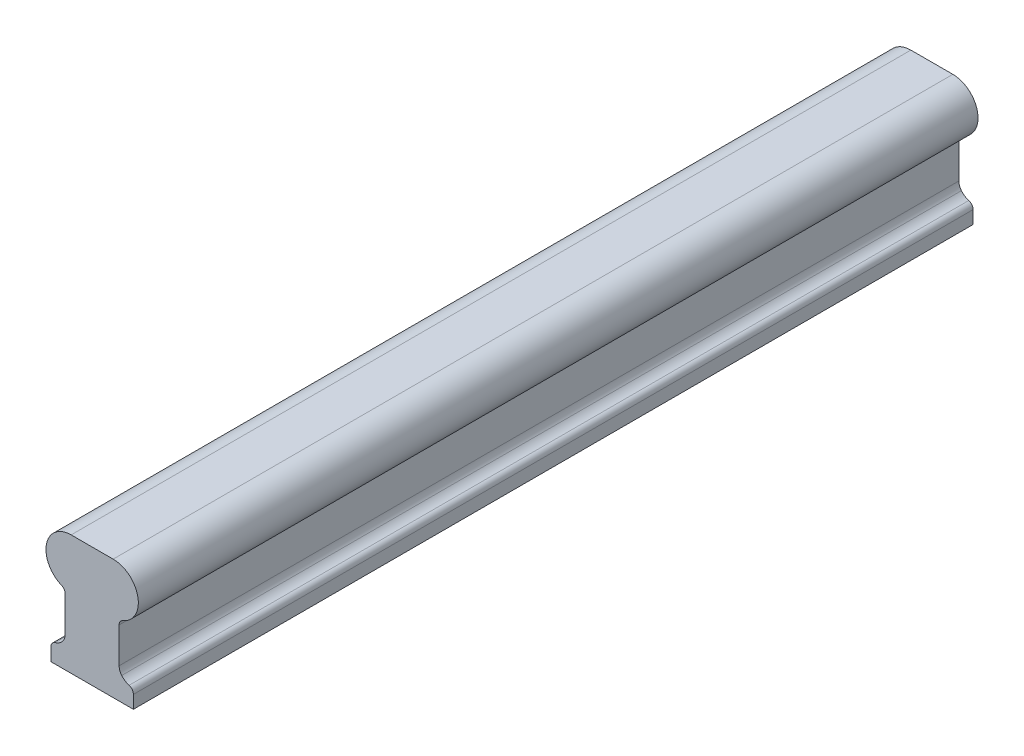
ISO-10303-21;
HEADER;
FILE_DESCRIPTION(('STEP AP214'),'2;1');
FILE_NAME('part.step','',(''),(''),'','','');
FILE_SCHEMA(('AUTOMOTIVE_DESIGN { 1 0 10303 214 1 1 1 1 }'));
ENDSEC;
DATA;
#1=APPLICATION_CONTEXT('core data for automotive mechanical design processes');
#2=APPLICATION_PROTOCOL_DEFINITION('international standard','automotive_design',2000,#1);
#3=PRODUCT_CONTEXT('',#1,'mechanical');
#4=PRODUCT('Part','Part','',(#3));
#5=PRODUCT_RELATED_PRODUCT_CATEGORY('part','',(#4));
#6=PRODUCT_DEFINITION_FORMATION('','',#4);
#7=PRODUCT_DEFINITION_CONTEXT('part definition',#1,'design');
#8=PRODUCT_DEFINITION('design','',#6,#7);
#9=PRODUCT_DEFINITION_SHAPE('','',#8);
#10=(LENGTH_UNIT() NAMED_UNIT(*) SI_UNIT(.MILLI.,.METRE.));
#11=(NAMED_UNIT(*) PLANE_ANGLE_UNIT() SI_UNIT($,.RADIAN.));
#12=(NAMED_UNIT(*) SI_UNIT($,.STERADIAN.) SOLID_ANGLE_UNIT());
#13=UNCERTAINTY_MEASURE_WITH_UNIT(LENGTH_MEASURE(1.E-05),#10,'distance_accuracy_value','');
#14=(GEOMETRIC_REPRESENTATION_CONTEXT(3) GLOBAL_UNCERTAINTY_ASSIGNED_CONTEXT((#13)) GLOBAL_UNIT_ASSIGNED_CONTEXT((#10,
#11,#12)) REPRESENTATION_CONTEXT('',''));
#15=CARTESIAN_POINT('',(0.,0.,0.));
#16=DIRECTION('',(0.,0.,1.));
#17=DIRECTION('',(1.,0.,0.));
#18=AXIS2_PLACEMENT_3D('',#15,#16,#17);
#19=CARTESIAN_POINT('',(0.,0.,355.6));
#20=DIRECTION('',(1.,0.,0.));
#21=DIRECTION('',(0.,0.,-1.));
#22=AXIS2_PLACEMENT_3D('',#19,#20,#21);
#23=PLANE('',#22);
#24=DIRECTION('',(0.,-1.,0.));
#25=VECTOR('',#24,1.);
#26=CARTESIAN_POINT('',(0.,0.,0.));
#27=LINE('',#26,#25);
#28=CARTESIAN_POINT('',(0.,5.4700903291992,0.));
#29=VERTEX_POINT('',#28);
#30=CARTESIAN_POINT('',(0.,0.,0.));
#31=VERTEX_POINT('',#30);
#32=EDGE_CURVE('E177',#29,#31,#27,.T.);
#33=ORIENTED_EDGE('',*,*,#32,.T.);
#34=DIRECTION('',(0.,0.,-1.));
#35=VECTOR('',#34,1.);
#36=CARTESIAN_POINT('',(0.,0.,355.6));
#37=LINE('',#36,#35);
#38=CARTESIAN_POINT('',(0.,0.,355.6));
#39=VERTEX_POINT('',#38);
#40=EDGE_CURVE('E11',#39,#31,#37,.T.);
#41=ORIENTED_EDGE('',*,*,#40,.F.);
#42=DIRECTION('',(0.,-1.,0.));
#43=VECTOR('',#42,1.);
#44=CARTESIAN_POINT('',(0.,0.,355.6));
#45=LINE('',#44,#43);
#46=CARTESIAN_POINT('',(0.,5.4700903291992,355.6));
#47=VERTEX_POINT('',#46);
#48=EDGE_CURVE('E207',#47,#39,#45,.T.);
#49=ORIENTED_EDGE('',*,*,#48,.F.);
#50=DIRECTION('',(0.,0.,-1.));
#51=VECTOR('',#50,1.);
#52=CARTESIAN_POINT('',(0.,5.4700903291992,355.6));
#53=LINE('',#52,#51);
#54=EDGE_CURVE('E173',#47,#29,#53,.T.);
#55=ORIENTED_EDGE('',*,*,#54,.T.);
#56=EDGE_LOOP('',(#33,#41,#49,#55));
#57=FACE_BOUND('',#56,.T.);
#58=ADVANCED_FACE('F33',(#57),#23,.F.);
#59=CARTESIAN_POINT('',(0.,0.,355.6));
#60=DIRECTION('',(0.,1.,0.));
#61=DIRECTION('',(0.,0.,1.));
#62=AXIS2_PLACEMENT_3D('',#59,#60,#61);
#63=PLANE('',#62);
#64=DIRECTION('',(1.,0.,0.));
#65=VECTOR('',#64,1.);
#66=CARTESIAN_POINT('',(0.,0.,0.));
#67=LINE('',#66,#65);
#68=CARTESIAN_POINT('',(34.925,0.,0.));
#69=VERTEX_POINT('',#68);
#70=EDGE_CURVE('E180',#31,#69,#67,.T.);
#71=ORIENTED_EDGE('',*,*,#70,.T.);
#72=DIRECTION('',(0.,0.,-1.));
#73=VECTOR('',#72,1.);
#74=CARTESIAN_POINT('',(34.925,0.,355.6));
#75=LINE('',#74,#73);
#76=CARTESIAN_POINT('',(34.925,0.,355.6));
#77=VERTEX_POINT('',#76);
#78=EDGE_CURVE('E41',#77,#69,#75,.T.);
#79=ORIENTED_EDGE('',*,*,#78,.F.);
#80=DIRECTION('',(1.,0.,0.));
#81=VECTOR('',#80,1.);
#82=CARTESIAN_POINT('',(0.,0.,355.6));
#83=LINE('',#82,#81);
#84=EDGE_CURVE('E116',#39,#77,#83,.T.);
#85=ORIENTED_EDGE('',*,*,#84,.F.);
#86=ORIENTED_EDGE('',*,*,#40,.T.);
#87=EDGE_LOOP('',(#71,#79,#85,#86));
#88=FACE_BOUND('',#87,.T.);
#89=ADVANCED_FACE('F305',(#88),#63,.F.);
#90=CARTESIAN_POINT('',(34.925,0.,355.6));
#91=DIRECTION('',(-1.,0.,0.));
#92=DIRECTION('',(0.,0.,1.));
#93=AXIS2_PLACEMENT_3D('',#90,#91,#92);
#94=PLANE('',#93);
#95=DIRECTION('',(0.,1.,0.));
#96=VECTOR('',#95,1.);
#97=CARTESIAN_POINT('',(34.925,0.,0.));
#98=LINE('',#97,#96);
#99=CARTESIAN_POINT('',(34.925,5.4700903291992,0.));
#100=VERTEX_POINT('',#99);
#101=EDGE_CURVE('E182',#69,#100,#98,.T.);
#102=ORIENTED_EDGE('',*,*,#101,.T.);
#103=DIRECTION('',(0.,0.,-1.));
#104=VECTOR('',#103,1.);
#105=CARTESIAN_POINT('',(34.925,5.4700903291992,355.6));
#106=LINE('',#105,#104);
#107=CARTESIAN_POINT('',(34.925,5.4700903291992,355.6));
#108=VERTEX_POINT('',#107);
#109=EDGE_CURVE('E238',#108,#100,#106,.T.);
#110=ORIENTED_EDGE('',*,*,#109,.F.);
#111=DIRECTION('',(0.,1.,0.));
#112=VECTOR('',#111,1.);
#113=CARTESIAN_POINT('',(34.925,0.,355.6));
#114=LINE('',#113,#112);
#115=EDGE_CURVE('E246',#77,#108,#114,.T.);
#116=ORIENTED_EDGE('',*,*,#115,.F.);
#117=ORIENTED_EDGE('',*,*,#78,.T.);
#118=EDGE_LOOP('',(#102,#110,#116,#117));
#119=FACE_BOUND('',#118,.T.);
#120=ADVANCED_FACE('F244',(#119),#94,.F.);
#121=CARTESIAN_POINT('',(32.385,5.4700903291992,355.6));
#122=DIRECTION('',(0.,0.,-1.));
#123=DIRECTION('',(-1.,0.,0.));
#124=AXIS2_PLACEMENT_3D('',#121,#122,#123);
#125=CYLINDRICAL_SURFACE('',#124,2.54);
#126=CARTESIAN_POINT('',(32.385,5.4700903291992,0.));
#127=DIRECTION('',(0.,0.,1.));
#128=DIRECTION('',(-1.,0.,0.));
#129=AXIS2_PLACEMENT_3D('',#126,#127,#128);
#130=CIRCLE('',#129,2.54);
#131=CARTESIAN_POINT('',(33.1030882831289,7.90647068079312,0.));
#132=VERTEX_POINT('',#131);
#133=EDGE_CURVE('E184',#100,#132,#130,.T.);
#134=ORIENTED_EDGE('',*,*,#133,.T.);
#135=DIRECTION('',(0.,0.,-1.));
#136=VECTOR('',#135,1.);
#137=CARTESIAN_POINT('',(33.1030882831289,7.90647068079312,355.6));
#138=LINE('',#137,#136);
#139=CARTESIAN_POINT('',(33.1030882831289,7.90647068079312,355.6));
#140=VERTEX_POINT('',#139);
#141=EDGE_CURVE('E235',#140,#132,#138,.T.);
#142=ORIENTED_EDGE('',*,*,#141,.F.);
#143=CARTESIAN_POINT('',(32.385,5.4700903291992,355.6));
#144=DIRECTION('',(0.,0.,1.));
#145=DIRECTION('',(-1.,0.,0.));
#146=AXIS2_PLACEMENT_3D('',#143,#144,#145);
#147=CIRCLE('',#146,2.54);
#148=EDGE_CURVE('E264',#108,#140,#147,.T.);
#149=ORIENTED_EDGE('',*,*,#148,.F.);
#150=ORIENTED_EDGE('',*,*,#109,.T.);
#151=EDGE_LOOP('',(#134,#142,#149,#150));
#152=FACE_BOUND('',#151,.T.);
#153=ADVANCED_FACE('F255',(#152),#125,.T.);
#154=CARTESIAN_POINT('',(34.925,14.0879806895373,355.6));
#155=DIRECTION('',(0.,0.,-1.));
#156=DIRECTION('',(-1.,0.,0.));
#157=AXIS2_PLACEMENT_3D('',#154,#155,#156);
#158=CYLINDRICAL_SURFACE('',#157,6.44441062412048);
#159=CARTESIAN_POINT('',(34.925,14.0879806895373,0.));
#160=DIRECTION('',(0.,0.,-1.));
#161=DIRECTION('',(-1.,0.,0.));
#162=AXIS2_PLACEMENT_3D('',#159,#160,#161);
#163=CIRCLE('',#162,6.44441062412048);
#164=CARTESIAN_POINT('',(29.9877953084063,9.94618903306999,0.));
#165=VERTEX_POINT('',#164);
#166=EDGE_CURVE('E186',#132,#165,#163,.T.);
#167=ORIENTED_EDGE('',*,*,#166,.T.);
#168=DIRECTION('',(0.,0.,-1.));
#169=VECTOR('',#168,1.);
#170=CARTESIAN_POINT('',(29.9877953084063,9.94618903306999,355.6));
#171=LINE('',#170,#169);
#172=CARTESIAN_POINT('',(29.9877953084063,9.94618903306999,355.6));
#173=VERTEX_POINT('',#172);
#174=EDGE_CURVE('E232',#173,#165,#171,.T.);
#175=ORIENTED_EDGE('',*,*,#174,.F.);
#176=CARTESIAN_POINT('',(34.925,14.0879806895373,355.6));
#177=DIRECTION('',(0.,0.,-1.));
#178=DIRECTION('',(-1.,0.,0.));
#179=AXIS2_PLACEMENT_3D('',#176,#177,#178);
#180=CIRCLE('',#179,6.44441062412048);
#181=EDGE_CURVE('E261',#140,#173,#180,.T.);
#182=ORIENTED_EDGE('',*,*,#181,.F.);
#183=ORIENTED_EDGE('',*,*,#141,.T.);
#184=EDGE_LOOP('',(#167,#175,#182,#183));
#185=FACE_BOUND('',#184,.T.);
#186=ADVANCED_FACE('F259',(#185),#158,.F.);
#187=CARTESIAN_POINT('',(33.5756906441674,12.9560530946583,355.6));
#188=DIRECTION('',(0.,0.,-1.));
#189=DIRECTION('',(-1.,0.,0.));
#190=AXIS2_PLACEMENT_3D('',#187,#188,#189);
#191=CYLINDRICAL_SURFACE('',#190,4.68319064416736);
#192=CARTESIAN_POINT('',(33.5756906441674,12.9560530946583,0.));
#193=DIRECTION('',(0.,0.,-1.));
#194=DIRECTION('',(1.,0.,0.));
#195=AXIS2_PLACEMENT_3D('',#192,#193,#194);
#196=CIRCLE('',#195,4.68319064416736);
#197=CARTESIAN_POINT('',(28.8925,12.9560530946583,0.));
#198=VERTEX_POINT('',#197);
#199=EDGE_CURVE('E188',#165,#198,#196,.T.);
#200=ORIENTED_EDGE('',*,*,#199,.T.);
#201=DIRECTION('',(0.,0.,-1.));
#202=VECTOR('',#201,1.);
#203=CARTESIAN_POINT('',(28.8925,12.9560530946583,355.6));
#204=LINE('',#203,#202);
#205=CARTESIAN_POINT('',(28.8925,12.9560530946583,355.6));
#206=VERTEX_POINT('',#205);
#207=EDGE_CURVE('E229',#206,#198,#204,.T.);
#208=ORIENTED_EDGE('',*,*,#207,.F.);
#209=CARTESIAN_POINT('',(33.5756906441674,12.9560530946583,355.6));
#210=DIRECTION('',(0.,0.,-1.));
#211=DIRECTION('',(1.,0.,0.));
#212=AXIS2_PLACEMENT_3D('',#209,#210,#211);
#213=CIRCLE('',#212,4.68319064416736);
#214=EDGE_CURVE('E263',#173,#206,#213,.T.);
#215=ORIENTED_EDGE('',*,*,#214,.F.);
#216=ORIENTED_EDGE('',*,*,#174,.T.);
#217=EDGE_LOOP('',(#200,#208,#215,#216));
#218=FACE_BOUND('',#217,.T.);
#219=ADVANCED_FACE('F318',(#218),#191,.F.);
#220=CARTESIAN_POINT('',(28.8925,27.94,355.6));
#221=DIRECTION('',(-1.,0.,0.));
#222=DIRECTION('',(0.,-1.,0.));
#223=AXIS2_PLACEMENT_3D('',#220,#221,#222);
#224=PLANE('',#223);
#225=DIRECTION('',(0.,1.,0.));
#226=VECTOR('',#225,1.);
#227=CARTESIAN_POINT('',(28.8925,27.94,0.));
#228=LINE('',#227,#226);
#229=CARTESIAN_POINT('',(28.8925,27.94,0.));
#230=VERTEX_POINT('',#229);
#231=EDGE_CURVE('E190',#198,#230,#228,.T.);
#232=ORIENTED_EDGE('',*,*,#231,.T.);
#233=DIRECTION('',(0.,0.,-1.));
#234=VECTOR('',#233,1.);
#235=CARTESIAN_POINT('',(28.8925,27.94,355.6));
#236=LINE('',#235,#234);
#237=CARTESIAN_POINT('',(28.8925,27.94,355.6));
#238=VERTEX_POINT('',#237);
#239=EDGE_CURVE('E226',#238,#230,#236,.T.);
#240=ORIENTED_EDGE('',*,*,#239,.F.);
#241=DIRECTION('',(0.,1.,0.));
#242=VECTOR('',#241,1.);
#243=CARTESIAN_POINT('',(28.8925,27.94,355.6));
#244=LINE('',#243,#242);
#245=EDGE_CURVE('E266',#206,#238,#244,.T.);
#246=ORIENTED_EDGE('',*,*,#245,.F.);
#247=ORIENTED_EDGE('',*,*,#207,.T.);
#248=EDGE_LOOP('',(#232,#240,#246,#247));
#249=FACE_BOUND('',#248,.T.);
#250=ADVANCED_FACE('F321',(#249),#224,.F.);
#251=CARTESIAN_POINT('',(31.4325,27.94,355.6));
#252=DIRECTION('',(0.,0.,-1.));
#253=DIRECTION('',(-1.,0.,0.));
#254=AXIS2_PLACEMENT_3D('',#251,#252,#253);
#255=CYLINDRICAL_SURFACE('',#254,2.54);
#256=CARTESIAN_POINT('',(31.4325,27.94,0.));
#257=DIRECTION('',(0.,0.,-1.));
#258=DIRECTION('',(-1.,0.,0.));
#259=AXIS2_PLACEMENT_3D('',#256,#257,#258);
#260=CIRCLE('',#259,2.54);
#261=CARTESIAN_POINT('',(30.4555769230769,30.2846153846154,0.));
#262=VERTEX_POINT('',#261);
#263=EDGE_CURVE('E192',#230,#262,#260,.T.);
#264=ORIENTED_EDGE('',*,*,#263,.T.);
#265=DIRECTION('',(0.,0.,-1.));
#266=VECTOR('',#265,1.);
#267=CARTESIAN_POINT('',(30.4555769230769,30.2846153846154,355.6));
#268=LINE('',#267,#266);
#269=CARTESIAN_POINT('',(30.4555769230769,30.2846153846154,355.6));
#270=VERTEX_POINT('',#269);
#271=EDGE_CURVE('E223',#270,#262,#268,.T.);
#272=ORIENTED_EDGE('',*,*,#271,.F.);
#273=CARTESIAN_POINT('',(31.4325,27.94,355.6));
#274=DIRECTION('',(0.,0.,-1.));
#275=DIRECTION('',(-1.,0.,0.));
#276=AXIS2_PLACEMENT_3D('',#273,#274,#275);
#277=CIRCLE('',#276,2.54);
#278=EDGE_CURVE('E272',#238,#270,#277,.T.);
#279=ORIENTED_EDGE('',*,*,#278,.F.);
#280=ORIENTED_EDGE('',*,*,#239,.T.);
#281=EDGE_LOOP('',(#264,#272,#279,#280));
#282=FACE_BOUND('',#281,.T.);
#283=ADVANCED_FACE('F325',(#282),#255,.F.);
#284=CARTESIAN_POINT('',(26.3525,40.132,355.6));
#285=DIRECTION('',(0.,0.,-1.));
#286=DIRECTION('',(-1.,0.,0.));
#287=AXIS2_PLACEMENT_3D('',#284,#285,#286);
#288=CYLINDRICAL_SURFACE('',#287,10.668);
#289=CARTESIAN_POINT('',(26.3525,40.132,0.));
#290=DIRECTION('',(0.,0.,1.));
#291=DIRECTION('',(-1.,0.,0.));
#292=AXIS2_PLACEMENT_3D('',#289,#290,#291);
#293=CIRCLE('',#292,10.668);
#294=CARTESIAN_POINT('',(26.3525,50.8,0.));
#295=VERTEX_POINT('',#294);
#296=EDGE_CURVE('E194',#262,#295,#293,.T.);
#297=ORIENTED_EDGE('',*,*,#296,.T.);
#298=DIRECTION('',(0.,0.,-1.));
#299=VECTOR('',#298,1.);
#300=CARTESIAN_POINT('',(26.3525,50.8,355.6));
#301=LINE('',#300,#299);
#302=CARTESIAN_POINT('',(26.3525,50.8,355.6));
#303=VERTEX_POINT('',#302);
#304=EDGE_CURVE('E220',#303,#295,#301,.T.);
#305=ORIENTED_EDGE('',*,*,#304,.F.);
#306=CARTESIAN_POINT('',(26.3525,40.132,355.6));
#307=DIRECTION('',(0.,0.,1.));
#308=DIRECTION('',(-1.,0.,0.));
#309=AXIS2_PLACEMENT_3D('',#306,#307,#308);
#310=CIRCLE('',#309,10.668);
#311=EDGE_CURVE('E274',#270,#303,#310,.T.);
#312=ORIENTED_EDGE('',*,*,#311,.F.);
#313=ORIENTED_EDGE('',*,*,#271,.T.);
#314=EDGE_LOOP('',(#297,#305,#312,#313));
#315=FACE_BOUND('',#314,.T.);
#316=ADVANCED_FACE('F329',(#315),#288,.T.);
#317=CARTESIAN_POINT('',(8.5725,50.8,355.6));
#318=DIRECTION('',(0.,-1.,0.));
#319=DIRECTION('',(0.,0.,-1.));
#320=AXIS2_PLACEMENT_3D('',#317,#318,#319);
#321=PLANE('',#320);
#322=DIRECTION('',(-1.,0.,0.));
#323=VECTOR('',#322,1.);
#324=CARTESIAN_POINT('',(8.5725,50.8,0.));
#325=LINE('',#324,#323);
#326=CARTESIAN_POINT('',(8.5725,50.8,0.));
#327=VERTEX_POINT('',#326);
#328=EDGE_CURVE('E196',#295,#327,#325,.T.);
#329=ORIENTED_EDGE('',*,*,#328,.T.);
#330=DIRECTION('',(0.,0.,-1.));
#331=VECTOR('',#330,1.);
#332=CARTESIAN_POINT('',(8.5725,50.8,355.6));
#333=LINE('',#332,#331);
#334=CARTESIAN_POINT('',(8.5725,50.8,355.6));
#335=VERTEX_POINT('',#334);
#336=EDGE_CURVE('E217',#335,#327,#333,.T.);
#337=ORIENTED_EDGE('',*,*,#336,.F.);
#338=DIRECTION('',(-1.,0.,0.));
#339=VECTOR('',#338,1.);
#340=CARTESIAN_POINT('',(8.5725,50.8,355.6));
#341=LINE('',#340,#339);
#342=EDGE_CURVE('E276',#303,#335,#341,.T.);
#343=ORIENTED_EDGE('',*,*,#342,.F.);
#344=ORIENTED_EDGE('',*,*,#304,.T.);
#345=EDGE_LOOP('',(#329,#337,#343,#344));
#346=FACE_BOUND('',#345,.T.);
#347=ADVANCED_FACE('F333',(#346),#321,.F.);
#348=CARTESIAN_POINT('',(8.5725,40.132,355.6));
#349=DIRECTION('',(0.,0.,-1.));
#350=DIRECTION('',(-1.,0.,0.));
#351=AXIS2_PLACEMENT_3D('',#348,#349,#350);
#352=CYLINDRICAL_SURFACE('',#351,10.668);
#353=CARTESIAN_POINT('',(8.5725,40.132,0.));
#354=DIRECTION('',(0.,0.,1.));
#355=DIRECTION('',(1.,0.,0.));
#356=AXIS2_PLACEMENT_3D('',#353,#354,#355);
#357=CIRCLE('',#356,10.668);
#358=CARTESIAN_POINT('',(4.46942307692308,30.2846153846154,0.));
#359=VERTEX_POINT('',#358);
#360=EDGE_CURVE('E198',#327,#359,#357,.T.);
#361=ORIENTED_EDGE('',*,*,#360,.T.);
#362=DIRECTION('',(0.,0.,-1.));
#363=VECTOR('',#362,1.);
#364=CARTESIAN_POINT('',(4.46942307692308,30.2846153846154,355.6));
#365=LINE('',#364,#363);
#366=CARTESIAN_POINT('',(4.46942307692308,30.2846153846154,355.6));
#367=VERTEX_POINT('',#366);
#368=EDGE_CURVE('E214',#367,#359,#365,.T.);
#369=ORIENTED_EDGE('',*,*,#368,.F.);
#370=CARTESIAN_POINT('',(8.5725,40.132,355.6));
#371=DIRECTION('',(0.,0.,1.));
#372=DIRECTION('',(1.,0.,0.));
#373=AXIS2_PLACEMENT_3D('',#370,#371,#372);
#374=CIRCLE('',#373,10.668);
#375=EDGE_CURVE('E278',#335,#367,#374,.T.);
#376=ORIENTED_EDGE('',*,*,#375,.F.);
#377=ORIENTED_EDGE('',*,*,#336,.T.);
#378=EDGE_LOOP('',(#361,#369,#376,#377));
#379=FACE_BOUND('',#378,.T.);
#380=ADVANCED_FACE('F337',(#379),#352,.T.);
#381=CARTESIAN_POINT('',(3.4925,27.94,355.6));
#382=DIRECTION('',(0.,0.,-1.));
#383=DIRECTION('',(-1.,0.,0.));
#384=AXIS2_PLACEMENT_3D('',#381,#382,#383);
#385=CYLINDRICAL_SURFACE('',#384,2.54);
#386=CARTESIAN_POINT('',(3.4925,27.94,0.));
#387=DIRECTION('',(0.,0.,-1.));
#388=DIRECTION('',(-1.,0.,0.));
#389=AXIS2_PLACEMENT_3D('',#386,#387,#388);
#390=CIRCLE('',#389,2.54);
#391=CARTESIAN_POINT('',(6.0325,27.94,0.));
#392=VERTEX_POINT('',#391);
#393=EDGE_CURVE('E200',#359,#392,#390,.T.);
#394=ORIENTED_EDGE('',*,*,#393,.T.);
#395=DIRECTION('',(0.,0.,-1.));
#396=VECTOR('',#395,1.);
#397=CARTESIAN_POINT('',(6.0325,27.94,355.6));
#398=LINE('',#397,#396);
#399=CARTESIAN_POINT('',(6.0325,27.94,355.6));
#400=VERTEX_POINT('',#399);
#401=EDGE_CURVE('E211',#400,#392,#398,.T.);
#402=ORIENTED_EDGE('',*,*,#401,.F.);
#403=CARTESIAN_POINT('',(3.4925,27.94,355.6));
#404=DIRECTION('',(0.,0.,-1.));
#405=DIRECTION('',(-1.,0.,0.));
#406=AXIS2_PLACEMENT_3D('',#403,#404,#405);
#407=CIRCLE('',#406,2.54);
#408=EDGE_CURVE('E280',#367,#400,#407,.T.);
#409=ORIENTED_EDGE('',*,*,#408,.F.);
#410=ORIENTED_EDGE('',*,*,#368,.T.);
#411=EDGE_LOOP('',(#394,#402,#409,#410));
#412=FACE_BOUND('',#411,.T.);
#413=ADVANCED_FACE('F286',(#412),#385,.F.);
#414=CARTESIAN_POINT('',(6.0325,27.94,355.6));
#415=DIRECTION('',(1.,0.,0.));
#416=DIRECTION('',(0.,1.,0.));
#417=AXIS2_PLACEMENT_3D('',#414,#415,#416);
#418=PLANE('',#417);
#419=DIRECTION('',(0.,-1.,0.));
#420=VECTOR('',#419,1.);
#421=CARTESIAN_POINT('',(6.0325,27.94,0.));
#422=LINE('',#421,#420);
#423=CARTESIAN_POINT('',(6.0325,12.9560530946583,0.));
#424=VERTEX_POINT('',#423);
#425=EDGE_CURVE('E202',#392,#424,#422,.T.);
#426=ORIENTED_EDGE('',*,*,#425,.T.);
#427=DIRECTION('',(0.,0.,-1.));
#428=VECTOR('',#427,1.);
#429=CARTESIAN_POINT('',(6.0325,12.9560530946583,355.6));
#430=LINE('',#429,#428);
#431=CARTESIAN_POINT('',(6.0325,12.9560530946583,355.6));
#432=VERTEX_POINT('',#431);
#433=EDGE_CURVE('E168',#432,#424,#430,.T.);
#434=ORIENTED_EDGE('',*,*,#433,.F.);
#435=DIRECTION('',(0.,-1.,0.));
#436=VECTOR('',#435,1.);
#437=CARTESIAN_POINT('',(6.0325,27.94,355.6));
#438=LINE('',#437,#436);
#439=EDGE_CURVE('E159',#400,#432,#438,.T.);
#440=ORIENTED_EDGE('',*,*,#439,.F.);
#441=ORIENTED_EDGE('',*,*,#401,.T.);
#442=EDGE_LOOP('',(#426,#434,#440,#441));
#443=FACE_BOUND('',#442,.T.);
#444=ADVANCED_FACE('F290',(#443),#418,.F.);
#445=CARTESIAN_POINT('',(1.34930935583265,12.9560530946583,355.6));
#446=DIRECTION('',(0.,0.,-1.));
#447=DIRECTION('',(-1.,0.,0.));
#448=AXIS2_PLACEMENT_3D('',#445,#446,#447);
#449=CYLINDRICAL_SURFACE('',#448,4.68319064416735);
#450=CARTESIAN_POINT('',(1.34930935583265,12.9560530946583,0.));
#451=DIRECTION('',(0.,0.,-1.));
#452=DIRECTION('',(-1.,0.,0.));
#453=AXIS2_PLACEMENT_3D('',#450,#451,#452);
#454=CIRCLE('',#453,4.68319064416735);
#455=CARTESIAN_POINT('',(4.93720469159367,9.94618903307001,0.));
#456=VERTEX_POINT('',#455);
#457=EDGE_CURVE('E167',#424,#456,#454,.T.);
#458=ORIENTED_EDGE('',*,*,#457,.T.);
#459=DIRECTION('',(0.,0.,-1.));
#460=VECTOR('',#459,1.);
#461=CARTESIAN_POINT('',(4.93720469159367,9.94618903307001,355.6));
#462=LINE('',#461,#460);
#463=CARTESIAN_POINT('',(4.93720469159367,9.94618903307001,355.6));
#464=VERTEX_POINT('',#463);
#465=EDGE_CURVE('E164',#464,#456,#462,.T.);
#466=ORIENTED_EDGE('',*,*,#465,.F.);
#467=CARTESIAN_POINT('',(1.34930935583265,12.9560530946583,355.6));
#468=DIRECTION('',(0.,0.,-1.));
#469=DIRECTION('',(-1.,0.,0.));
#470=AXIS2_PLACEMENT_3D('',#467,#468,#469);
#471=CIRCLE('',#470,4.68319064416735);
#472=EDGE_CURVE('E153',#432,#464,#471,.T.);
#473=ORIENTED_EDGE('',*,*,#472,.F.);
#474=ORIENTED_EDGE('',*,*,#433,.T.);
#475=EDGE_LOOP('',(#458,#466,#473,#474));
#476=FACE_BOUND('',#475,.T.);
#477=ADVANCED_FACE('F165',(#476),#449,.F.);
#478=CARTESIAN_POINT('',(0.,14.0879806895373,355.6));
#479=DIRECTION('',(0.,0.,-1.));
#480=DIRECTION('',(-1.,0.,0.));
#481=AXIS2_PLACEMENT_3D('',#478,#479,#480);
#482=CYLINDRICAL_SURFACE('',#481,6.44441062412048);
#483=CARTESIAN_POINT('',(0.,14.0879806895373,0.));
#484=DIRECTION('',(0.,0.,-1.));
#485=DIRECTION('',(1.,0.,0.));
#486=AXIS2_PLACEMENT_3D('',#483,#484,#485);
#487=CIRCLE('',#486,6.44441062412048);
#488=CARTESIAN_POINT('',(1.82191171687107,7.90647068079313,0.));
#489=VERTEX_POINT('',#488);
#490=EDGE_CURVE('E102',#456,#489,#487,.T.);
#491=ORIENTED_EDGE('',*,*,#490,.T.);
#492=DIRECTION('',(0.,0.,-1.));
#493=VECTOR('',#492,1.);
#494=CARTESIAN_POINT('',(1.82191171687107,7.90647068079313,355.6));
#495=LINE('',#494,#493);
#496=CARTESIAN_POINT('',(1.82191171687107,7.90647068079313,355.6));
#497=VERTEX_POINT('',#496);
#498=EDGE_CURVE('E169',#497,#489,#495,.T.);
#499=ORIENTED_EDGE('',*,*,#498,.F.);
#500=CARTESIAN_POINT('',(0.,14.0879806895373,355.6));
#501=DIRECTION('',(0.,0.,-1.));
#502=DIRECTION('',(1.,0.,0.));
#503=AXIS2_PLACEMENT_3D('',#500,#501,#502);
#504=CIRCLE('',#503,6.44441062412048);
#505=EDGE_CURVE('E157',#464,#497,#504,.T.);
#506=ORIENTED_EDGE('',*,*,#505,.F.);
#507=ORIENTED_EDGE('',*,*,#465,.T.);
#508=EDGE_LOOP('',(#491,#499,#506,#507));
#509=FACE_BOUND('',#508,.T.);
#510=ADVANCED_FACE('F171',(#509),#482,.F.);
#511=CARTESIAN_POINT('',(2.54,5.4700903291992,355.6));
#512=DIRECTION('',(0.,0.,-1.));
#513=DIRECTION('',(-1.,0.,0.));
#514=AXIS2_PLACEMENT_3D('',#511,#512,#513);
#515=CYLINDRICAL_SURFACE('',#514,2.54);
#516=CARTESIAN_POINT('',(2.54,5.4700903291992,0.));
#517=DIRECTION('',(0.,0.,1.));
#518=DIRECTION('',(-1.,0.,0.));
#519=AXIS2_PLACEMENT_3D('',#516,#517,#518);
#520=CIRCLE('',#519,2.54);
#521=EDGE_CURVE('E108',#489,#29,#520,.T.);
#522=ORIENTED_EDGE('',*,*,#521,.T.);
#523=ORIENTED_EDGE('',*,*,#54,.F.);
#524=CARTESIAN_POINT('',(2.54,5.4700903291992,355.6));
#525=DIRECTION('',(0.,0.,1.));
#526=DIRECTION('',(-1.,0.,0.));
#527=AXIS2_PLACEMENT_3D('',#524,#525,#526);
#528=CIRCLE('',#527,2.54);
#529=EDGE_CURVE('E49',#497,#47,#528,.T.);
#530=ORIENTED_EDGE('',*,*,#529,.F.);
#531=ORIENTED_EDGE('',*,*,#498,.T.);
#532=EDGE_LOOP('',(#522,#523,#530,#531));
#533=FACE_BOUND('',#532,.T.);
#534=ADVANCED_FACE('F294',(#533),#515,.T.);
#535=CARTESIAN_POINT('',(2.54,5.4700903291992,355.6));
#536=DIRECTION('',(0.,0.,-1.));
#537=DIRECTION('',(-1.,0.,0.));
#538=AXIS2_PLACEMENT_3D('',#535,#536,#537);
#539=PLANE('',#538);
#540=ORIENTED_EDGE('',*,*,#48,.T.);
#541=ORIENTED_EDGE('',*,*,#84,.T.);
#542=ORIENTED_EDGE('',*,*,#115,.T.);
#543=ORIENTED_EDGE('',*,*,#148,.T.);
#544=ORIENTED_EDGE('',*,*,#181,.T.);
#545=ORIENTED_EDGE('',*,*,#214,.T.);
#546=ORIENTED_EDGE('',*,*,#245,.T.);
#547=ORIENTED_EDGE('',*,*,#278,.T.);
#548=ORIENTED_EDGE('',*,*,#311,.T.);
#549=ORIENTED_EDGE('',*,*,#342,.T.);
#550=ORIENTED_EDGE('',*,*,#375,.T.);
#551=ORIENTED_EDGE('',*,*,#408,.T.);
#552=ORIENTED_EDGE('',*,*,#439,.T.);
#553=ORIENTED_EDGE('',*,*,#472,.T.);
#554=ORIENTED_EDGE('',*,*,#505,.T.);
#555=ORIENTED_EDGE('',*,*,#529,.T.);
#556=EDGE_LOOP('',(#540,#541,#542,#543,#544,#545,#546,#547,#548,#549,#550,#551,#552,#553,#554,#555));
#557=FACE_BOUND('',#556,.T.);
#558=ADVANCED_FACE('F155',(#557),#539,.F.);
#559=CARTESIAN_POINT('',(2.54,5.4700903291992,0.));
#560=DIRECTION('',(0.,0.,-1.));
#561=DIRECTION('',(-1.,0.,0.));
#562=AXIS2_PLACEMENT_3D('',#559,#560,#561);
#563=PLANE('',#562);
#564=ORIENTED_EDGE('',*,*,#32,.F.);
#565=ORIENTED_EDGE('',*,*,#521,.F.);
#566=ORIENTED_EDGE('',*,*,#490,.F.);
#567=ORIENTED_EDGE('',*,*,#457,.F.);
#568=ORIENTED_EDGE('',*,*,#425,.F.);
#569=ORIENTED_EDGE('',*,*,#393,.F.);
#570=ORIENTED_EDGE('',*,*,#360,.F.);
#571=ORIENTED_EDGE('',*,*,#328,.F.);
#572=ORIENTED_EDGE('',*,*,#296,.F.);
#573=ORIENTED_EDGE('',*,*,#263,.F.);
#574=ORIENTED_EDGE('',*,*,#231,.F.);
#575=ORIENTED_EDGE('',*,*,#199,.F.);
#576=ORIENTED_EDGE('',*,*,#166,.F.);
#577=ORIENTED_EDGE('',*,*,#133,.F.);
#578=ORIENTED_EDGE('',*,*,#101,.F.);
#579=ORIENTED_EDGE('',*,*,#70,.F.);
#580=EDGE_LOOP('',(#564,#565,#566,#567,#568,#569,#570,#571,#572,#573,#574,#575,#576,#577,#578,#579));
#581=FACE_BOUND('',#580,.T.);
#582=ADVANCED_FACE('F250',(#581),#563,.T.);
#583=CLOSED_SHELL('',(#58,#89,#120,#153,#186,#219,#250,#283,#316,#347,#380,#413,#444,#477,#510,
#534,#558,#582));
#584=MANIFOLD_SOLID_BREP('B2',#583);
#585=ADVANCED_BREP_SHAPE_REPRESENTATION('',(#18,#584),#14);
#586=SHAPE_DEFINITION_REPRESENTATION(#9,#585);
ENDSEC;
END-ISO-10303-21;
